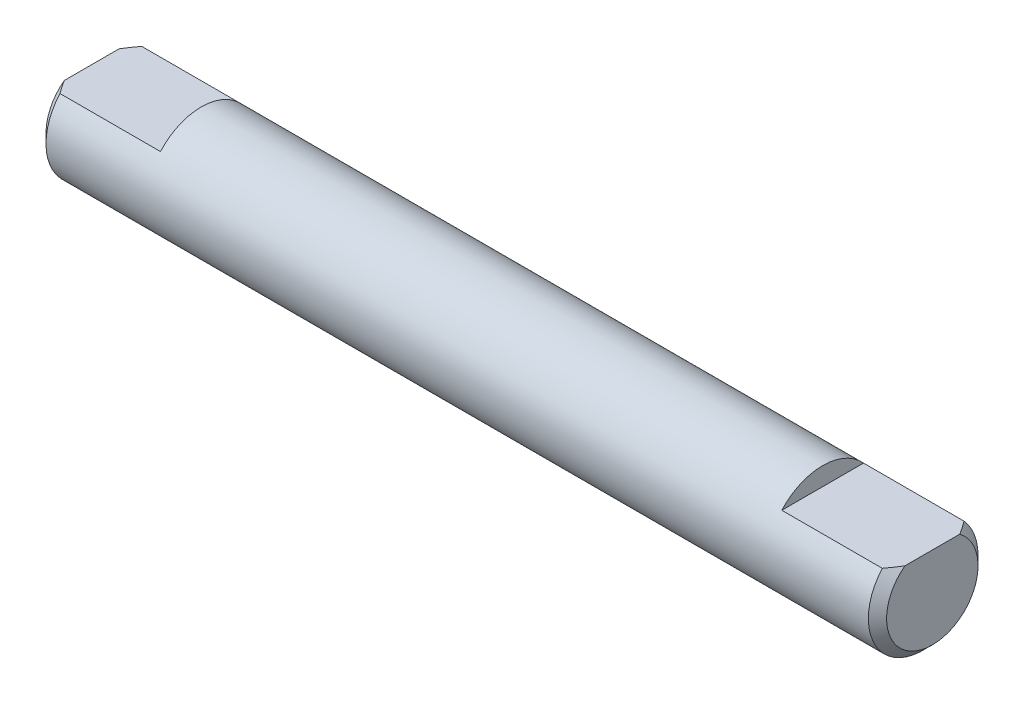
ISO-10303-21;
HEADER;
FILE_DESCRIPTION(('STEP AP214'),'2;1');
FILE_NAME('part.step','',(''),(''),'','','');
FILE_SCHEMA(('AUTOMOTIVE_DESIGN { 1 0 10303 214 1 1 1 1 }'));
ENDSEC;
DATA;
#1=APPLICATION_CONTEXT('core data for automotive mechanical design processes');
#2=APPLICATION_PROTOCOL_DEFINITION('international standard','automotive_design',2000,#1);
#3=PRODUCT_CONTEXT('',#1,'mechanical');
#4=PRODUCT('Part','Part','',(#3));
#5=PRODUCT_RELATED_PRODUCT_CATEGORY('part','',(#4));
#6=PRODUCT_DEFINITION_FORMATION('','',#4);
#7=PRODUCT_DEFINITION_CONTEXT('part definition',#1,'design');
#8=PRODUCT_DEFINITION('design','',#6,#7);
#9=PRODUCT_DEFINITION_SHAPE('','',#8);
#10=(LENGTH_UNIT() NAMED_UNIT(*) SI_UNIT(.MILLI.,.METRE.));
#11=(NAMED_UNIT(*) PLANE_ANGLE_UNIT() SI_UNIT($,.RADIAN.));
#12=(NAMED_UNIT(*) SI_UNIT($,.STERADIAN.) SOLID_ANGLE_UNIT());
#13=UNCERTAINTY_MEASURE_WITH_UNIT(LENGTH_MEASURE(1.E-05),#10,'distance_accuracy_value','');
#14=(GEOMETRIC_REPRESENTATION_CONTEXT(3) GLOBAL_UNCERTAINTY_ASSIGNED_CONTEXT((#13)) GLOBAL_UNIT_ASSIGNED_CONTEXT((#10,
#11,#12)) REPRESENTATION_CONTEXT('',''));
#15=CARTESIAN_POINT('',(0.,0.,0.));
#16=DIRECTION('',(0.,0.,1.));
#17=DIRECTION('',(1.,0.,0.));
#18=AXIS2_PLACEMENT_3D('',#15,#16,#17);
#19=CARTESIAN_POINT('',(0.,-2.99999999999999,0.));
#20=DIRECTION('',(-1.,0.,0.));
#21=DIRECTION('',(0.,0.,1.));
#22=AXIS2_PLACEMENT_3D('',#19,#20,#21);
#23=PLANE('',#22);
#24=DIRECTION('',(0.,0.,1.));
#25=VECTOR('',#24,1.);
#26=CARTESIAN_POINT('',(0.,2.,-2.23606797749978));
#27=LINE('',#26,#25);
#28=CARTESIAN_POINT('',(0.,2.,-1.5));
#29=VERTEX_POINT('',#28);
#30=CARTESIAN_POINT('',(0.,2.,1.5));
#31=VERTEX_POINT('',#30);
#32=EDGE_CURVE('E112',#29,#31,#27,.T.);
#33=ORIENTED_EDGE('',*,*,#32,.F.);
#34=CARTESIAN_POINT('',(0.,0.,0.));
#35=DIRECTION('',(-1.,0.,0.));
#36=DIRECTION('',(0.,0.,1.));
#37=AXIS2_PLACEMENT_3D('',#34,#35,#36);
#38=CIRCLE('',#37,2.5);
#39=EDGE_CURVE('E176',#29,#31,#38,.T.);
#40=ORIENTED_EDGE('',*,*,#39,.T.);
#41=EDGE_LOOP('',(#33,#40));
#42=FACE_BOUND('',#41,.T.);
#43=ADVANCED_FACE('F45',(#42),#23,.T.);
#44=CARTESIAN_POINT('',(46.,0.,0.));
#45=DIRECTION('',(1.,0.,0.));
#46=DIRECTION('',(0.,0.,-1.));
#47=AXIS2_PLACEMENT_3D('',#44,#45,#46);
#48=PLANE('',#47);
#49=DIRECTION('',(0.,0.,-1.));
#50=VECTOR('',#49,1.);
#51=CARTESIAN_POINT('',(46.,2.,2.23606797749978));
#52=LINE('',#51,#50);
#53=CARTESIAN_POINT('',(46.,2.,1.5));
#54=VERTEX_POINT('',#53);
#55=CARTESIAN_POINT('',(46.,2.,-1.5));
#56=VERTEX_POINT('',#55);
#57=EDGE_CURVE('E122',#54,#56,#52,.T.);
#58=ORIENTED_EDGE('',*,*,#57,.F.);
#59=CARTESIAN_POINT('',(46.,0.,0.));
#60=DIRECTION('',(1.,0.,0.));
#61=DIRECTION('',(0.,0.,-1.));
#62=AXIS2_PLACEMENT_3D('',#59,#60,#61);
#63=CIRCLE('',#62,2.5);
#64=EDGE_CURVE('E177',#54,#56,#63,.T.);
#65=ORIENTED_EDGE('',*,*,#64,.T.);
#66=EDGE_LOOP('',(#58,#65));
#67=FACE_BOUND('',#66,.T.);
#68=ADVANCED_FACE('F169',(#67),#48,.T.);
#69=CARTESIAN_POINT('',(0.,0.,0.));
#70=DIRECTION('',(-1.,0.,0.));
#71=DIRECTION('',(0.,0.,1.));
#72=AXIS2_PLACEMENT_3D('',#69,#70,#71);
#73=CYLINDRICAL_SURFACE('',#72,2.99999999999999);
#74=DIRECTION('',(-1.,0.,0.));
#75=VECTOR('',#74,1.);
#76=CARTESIAN_POINT('',(6.,2.,2.23606797749978));
#77=LINE('',#76,#75);
#78=CARTESIAN_POINT('',(6.,2.,2.23606797749978));
#79=VERTEX_POINT('',#78);
#80=CARTESIAN_POINT('',(0.499999999999995,2.,2.23606797749978));
#81=VERTEX_POINT('',#80);
#82=EDGE_CURVE('E116',#79,#81,#77,.T.);
#83=ORIENTED_EDGE('',*,*,#82,.T.);
#84=CARTESIAN_POINT('',(0.499999999999995,0.,0.));
#85=DIRECTION('',(-1.,0.,0.));
#86=DIRECTION('',(0.,0.,1.));
#87=AXIS2_PLACEMENT_3D('',#84,#85,#86);
#88=CIRCLE('',#87,2.99999999999999);
#89=CARTESIAN_POINT('',(0.499999999999995,2.,-2.23606797749978));
#90=VERTEX_POINT('',#89);
#91=EDGE_CURVE('E120',#81,#90,#88,.F.);
#92=ORIENTED_EDGE('',*,*,#91,.T.);
#93=DIRECTION('',(-1.,0.,0.));
#94=VECTOR('',#93,1.);
#95=CARTESIAN_POINT('',(6.,2.,-2.23606797749978));
#96=LINE('',#95,#94);
#97=CARTESIAN_POINT('',(6.,2.,-2.23606797749978));
#98=VERTEX_POINT('',#97);
#99=EDGE_CURVE('E115',#98,#90,#96,.T.);
#100=ORIENTED_EDGE('',*,*,#99,.F.);
#101=CARTESIAN_POINT('',(6.,0.,0.));
#102=DIRECTION('',(-1.,0.,0.));
#103=DIRECTION('',(0.,0.,1.));
#104=AXIS2_PLACEMENT_3D('',#101,#102,#103);
#105=CIRCLE('',#104,2.99999999999999);
#106=EDGE_CURVE('E104',#79,#98,#105,.T.);
#107=ORIENTED_EDGE('',*,*,#106,.F.);
#108=EDGE_LOOP('',(#83,#92,#100,#107));
#109=FACE_BOUND('',#108,.T.);
#110=DIRECTION('',(1.,0.,0.));
#111=VECTOR('',#110,1.);
#112=CARTESIAN_POINT('',(40.,2.,-2.23606797749978));
#113=LINE('',#112,#111);
#114=CARTESIAN_POINT('',(40.,2.,-2.23606797749978));
#115=VERTEX_POINT('',#114);
#116=CARTESIAN_POINT('',(45.5,2.,-2.23606797749978));
#117=VERTEX_POINT('',#116);
#118=EDGE_CURVE('E133',#115,#117,#113,.T.);
#119=ORIENTED_EDGE('',*,*,#118,.T.);
#120=CARTESIAN_POINT('',(45.5,0.,0.));
#121=DIRECTION('',(1.,0.,0.));
#122=DIRECTION('',(0.,0.,-1.));
#123=AXIS2_PLACEMENT_3D('',#120,#121,#122);
#124=CIRCLE('',#123,2.99999999999999);
#125=CARTESIAN_POINT('',(45.5,2.,2.23606797749978));
#126=VERTEX_POINT('',#125);
#127=EDGE_CURVE('E139',#117,#126,#124,.F.);
#128=ORIENTED_EDGE('',*,*,#127,.T.);
#129=DIRECTION('',(1.,0.,0.));
#130=VECTOR('',#129,1.);
#131=CARTESIAN_POINT('',(40.,2.,2.23606797749978));
#132=LINE('',#131,#130);
#133=CARTESIAN_POINT('',(40.,2.,2.23606797749978));
#134=VERTEX_POINT('',#133);
#135=EDGE_CURVE('E130',#134,#126,#132,.T.);
#136=ORIENTED_EDGE('',*,*,#135,.F.);
#137=CARTESIAN_POINT('',(40.,0.,0.));
#138=DIRECTION('',(1.,0.,0.));
#139=DIRECTION('',(0.,0.,-1.));
#140=AXIS2_PLACEMENT_3D('',#137,#138,#139);
#141=CIRCLE('',#140,2.99999999999999);
#142=EDGE_CURVE('E126',#115,#134,#141,.T.);
#143=ORIENTED_EDGE('',*,*,#142,.F.);
#144=EDGE_LOOP('',(#119,#128,#136,#143));
#145=FACE_BOUND('',#144,.T.);
#146=ADVANCED_FACE('F118',(#109,#145),#73,.T.);
#147=CARTESIAN_POINT('',(40.,2.,2.23606797749978));
#148=DIRECTION('',(0.,-1.,0.));
#149=DIRECTION('',(0.,0.,-1.));
#150=AXIS2_PLACEMENT_3D('',#147,#148,#149);
#151=PLANE('',#150);
#152=ORIENTED_EDGE('',*,*,#135,.T.);
#153=CARTESIAN_POINT('',(45.5,2.,2.23606797749978));
#154=CARTESIAN_POINT('',(45.5443329228987,2.,2.17657340830976));
#155=CARTESIAN_POINT('',(45.5881782263033,2.,2.11670900846292));
#156=CARTESIAN_POINT('',(45.6746166557635,2.,1.99613946258492));
#157=CARTESIAN_POINT('',(45.7172105304513,2.,1.93543485253753));
#158=CARTESIAN_POINT('',(45.800930975112,2.,1.81300116191587));
#159=CARTESIAN_POINT('',(45.8420572974233,2.,1.75127191097625));
#160=CARTESIAN_POINT('',(45.9224920359348,2.,1.62658889898815));
#161=CARTESIAN_POINT('',(45.9617993221427,2.,1.56363441041135));
#162=CARTESIAN_POINT('',(46.,2.,1.5));
#163=B_SPLINE_CURVE_WITH_KNOTS('',3,(#153,#154,#155,#156,#157,#158,#159,#160,#161,#162),
.UNSPECIFIED.,.F.,.F.,(4,2,2,2,4),(0.,0.222592117650802,0.445048246319036,0.667541740446228,
0.89017164236837),.UNSPECIFIED.);
#164=EDGE_CURVE('E149',#126,#54,#163,.T.);
#165=ORIENTED_EDGE('',*,*,#164,.T.);
#166=ORIENTED_EDGE('',*,*,#57,.T.);
#167=CARTESIAN_POINT('',(46.,2.,-1.5));
#168=CARTESIAN_POINT('',(45.9617993221427,2.,-1.56363441041135));
#169=CARTESIAN_POINT('',(45.9224920359348,2.,-1.62658889898815));
#170=CARTESIAN_POINT('',(45.8420572974233,2.,-1.75127191097625));
#171=CARTESIAN_POINT('',(45.800930975112,2.,-1.81300116191587));
#172=CARTESIAN_POINT('',(45.7172105304513,2.,-1.93543485253752));
#173=CARTESIAN_POINT('',(45.6746166557635,2.,-1.99613946258491));
#174=CARTESIAN_POINT('',(45.5881782263033,2.,-2.11670900846292));
#175=CARTESIAN_POINT('',(45.5443329228987,2.,-2.17657340830976));
#176=CARTESIAN_POINT('',(45.5,2.,-2.23606797749978));
#177=B_SPLINE_CURVE_WITH_KNOTS('',3,(#167,#168,#169,#170,#171,#172,#173,#174,#175,#176),
.UNSPECIFIED.,.F.,.F.,(4,2,2,2,4),(0.,0.222629901922141,0.445123396049333,0.66757952471756,
0.890171642368367),.UNSPECIFIED.);
#178=EDGE_CURVE('E142',#56,#117,#177,.T.);
#179=ORIENTED_EDGE('',*,*,#178,.T.);
#180=ORIENTED_EDGE('',*,*,#118,.F.);
#181=DIRECTION('',(0.,0.,-1.));
#182=VECTOR('',#181,1.);
#183=CARTESIAN_POINT('',(40.,2.,2.23606797749978));
#184=LINE('',#183,#182);
#185=EDGE_CURVE('E128',#134,#115,#184,.T.);
#186=ORIENTED_EDGE('',*,*,#185,.F.);
#187=EDGE_LOOP('',(#152,#165,#166,#179,#180,#186));
#188=FACE_BOUND('',#187,.T.);
#189=ADVANCED_FACE('F159',(#188),#151,.F.);
#190=CARTESIAN_POINT('',(40.,0.,0.));
#191=DIRECTION('',(1.,0.,0.));
#192=DIRECTION('',(0.,0.,-1.));
#193=AXIS2_PLACEMENT_3D('',#190,#191,#192);
#194=PLANE('',#193);
#195=ORIENTED_EDGE('',*,*,#142,.T.);
#196=ORIENTED_EDGE('',*,*,#185,.T.);
#197=EDGE_LOOP('',(#195,#196));
#198=FACE_BOUND('',#197,.T.);
#199=ADVANCED_FACE('F164',(#198),#194,.T.);
#200=CARTESIAN_POINT('',(6.,2.,-2.23606797749978));
#201=DIRECTION('',(0.,-1.,0.));
#202=DIRECTION('',(0.,0.,-1.));
#203=AXIS2_PLACEMENT_3D('',#200,#201,#202);
#204=PLANE('',#203);
#205=ORIENTED_EDGE('',*,*,#32,.T.);
#206=CARTESIAN_POINT('',(0.,2.,1.5));
#207=CARTESIAN_POINT('',(0.0382006778573219,2.,1.56363441041136));
#208=CARTESIAN_POINT('',(0.0775079640651531,2.,1.62658889898815));
#209=CARTESIAN_POINT('',(0.157942702576657,2.,1.75127191097625));
#210=CARTESIAN_POINT('',(0.199069024887962,2.,1.81300116191587));
#211=CARTESIAN_POINT('',(0.282789469548689,2.,1.93543485253753));
#212=CARTESIAN_POINT('',(0.325383344236507,2.,1.99613946258492));
#213=CARTESIAN_POINT('',(0.41182177369665,2.,2.11670900846293));
#214=CARTESIAN_POINT('',(0.455667077101261,2.,2.17657340830976));
#215=CARTESIAN_POINT('',(0.499999999999995,2.,2.23606797749978));
#216=B_SPLINE_CURVE_WITH_KNOTS('',3,(#206,#207,#208,#209,#210,#211,#212,#213,#214,#215),
.UNSPECIFIED.,.F.,.F.,(4,2,2,2,4),(0.,0.222629901922141,0.445123396049332,0.667579524717558,
0.890171642368361),.UNSPECIFIED.);
#217=EDGE_CURVE('E11',#31,#81,#216,.T.);
#218=ORIENTED_EDGE('',*,*,#217,.T.);
#219=ORIENTED_EDGE('',*,*,#82,.F.);
#220=DIRECTION('',(0.,0.,1.));
#221=VECTOR('',#220,1.);
#222=CARTESIAN_POINT('',(6.,2.,-2.23606797749978));
#223=LINE('',#222,#221);
#224=EDGE_CURVE('E107',#98,#79,#223,.T.);
#225=ORIENTED_EDGE('',*,*,#224,.F.);
#226=ORIENTED_EDGE('',*,*,#99,.T.);
#227=CARTESIAN_POINT('',(0.499999999999995,2.,-2.23606797749978));
#228=CARTESIAN_POINT('',(0.455667077101261,2.,-2.17657340830976));
#229=CARTESIAN_POINT('',(0.411821773696651,2.,-2.11670900846293));
#230=CARTESIAN_POINT('',(0.325383344236508,2.,-1.99613946258492));
#231=CARTESIAN_POINT('',(0.28278946954869,2.,-1.93543485253753));
#232=CARTESIAN_POINT('',(0.199069024887962,2.,-1.81300116191587));
#233=CARTESIAN_POINT('',(0.157942702576657,2.,-1.75127191097625));
#234=CARTESIAN_POINT('',(0.0775079640651532,2.,-1.62658889898815));
#235=CARTESIAN_POINT('',(0.0382006778573221,2.,-1.56363441041136));
#236=CARTESIAN_POINT('',(0.,2.,-1.5));
#237=B_SPLINE_CURVE_WITH_KNOTS('',3,(#227,#228,#229,#230,#231,#232,#233,#234,#235,#236),
.UNSPECIFIED.,.F.,.F.,(4,2,2,2,4),(0.,0.222592117650803,0.445048246319029,0.66754174044622,
0.890171642368361),.UNSPECIFIED.);
#238=EDGE_CURVE('E60',#90,#29,#237,.T.);
#239=ORIENTED_EDGE('',*,*,#238,.T.);
#240=EDGE_LOOP('',(#205,#218,#219,#225,#226,#239));
#241=FACE_BOUND('',#240,.T.);
#242=ADVANCED_FACE('F114',(#241),#204,.F.);
#243=CARTESIAN_POINT('',(6.,0.,0.));
#244=DIRECTION('',(-1.,0.,0.));
#245=DIRECTION('',(0.,0.,1.));
#246=AXIS2_PLACEMENT_3D('',#243,#244,#245);
#247=PLANE('',#246);
#248=ORIENTED_EDGE('',*,*,#106,.T.);
#249=ORIENTED_EDGE('',*,*,#224,.T.);
#250=EDGE_LOOP('',(#248,#249));
#251=FACE_BOUND('',#250,.T.);
#252=ADVANCED_FACE('F106',(#251),#247,.T.);
#253=CARTESIAN_POINT('',(45.5,0.,0.));
#254=DIRECTION('',(-1.,0.,0.));
#255=DIRECTION('',(0.,0.,1.));
#256=AXIS2_PLACEMENT_3D('',#253,#254,#255);
#257=CONICAL_SURFACE('',#256,2.99999999999999,0.785398163397444);
#258=ORIENTED_EDGE('',*,*,#178,.F.);
#259=ORIENTED_EDGE('',*,*,#64,.F.);
#260=ORIENTED_EDGE('',*,*,#164,.F.);
#261=ORIENTED_EDGE('',*,*,#127,.F.);
#262=EDGE_LOOP('',(#258,#259,#260,#261));
#263=FACE_BOUND('',#262,.T.);
#264=ADVANCED_FACE('F156',(#263),#257,.T.);
#265=CARTESIAN_POINT('',(0.,0.,0.));
#266=DIRECTION('',(1.,0.,0.));
#267=DIRECTION('',(0.,0.,-1.));
#268=AXIS2_PLACEMENT_3D('',#265,#266,#267);
#269=CONICAL_SURFACE('',#268,2.5,0.785398163397445);
#270=ORIENTED_EDGE('',*,*,#238,.F.);
#271=ORIENTED_EDGE('',*,*,#91,.F.);
#272=ORIENTED_EDGE('',*,*,#217,.F.);
#273=ORIENTED_EDGE('',*,*,#39,.F.);
#274=EDGE_LOOP('',(#270,#271,#272,#273));
#275=FACE_BOUND('',#274,.T.);
#276=ADVANCED_FACE('F48',(#275),#269,.T.);
#277=CLOSED_SHELL('',(#43,#68,#146,#189,#199,#242,#252,#264,#276));
#278=MANIFOLD_SOLID_BREP('B2',#277);
#279=ADVANCED_BREP_SHAPE_REPRESENTATION('',(#18,#278),#14);
#280=SHAPE_DEFINITION_REPRESENTATION(#9,#279);
ENDSEC;
END-ISO-10303-21;
